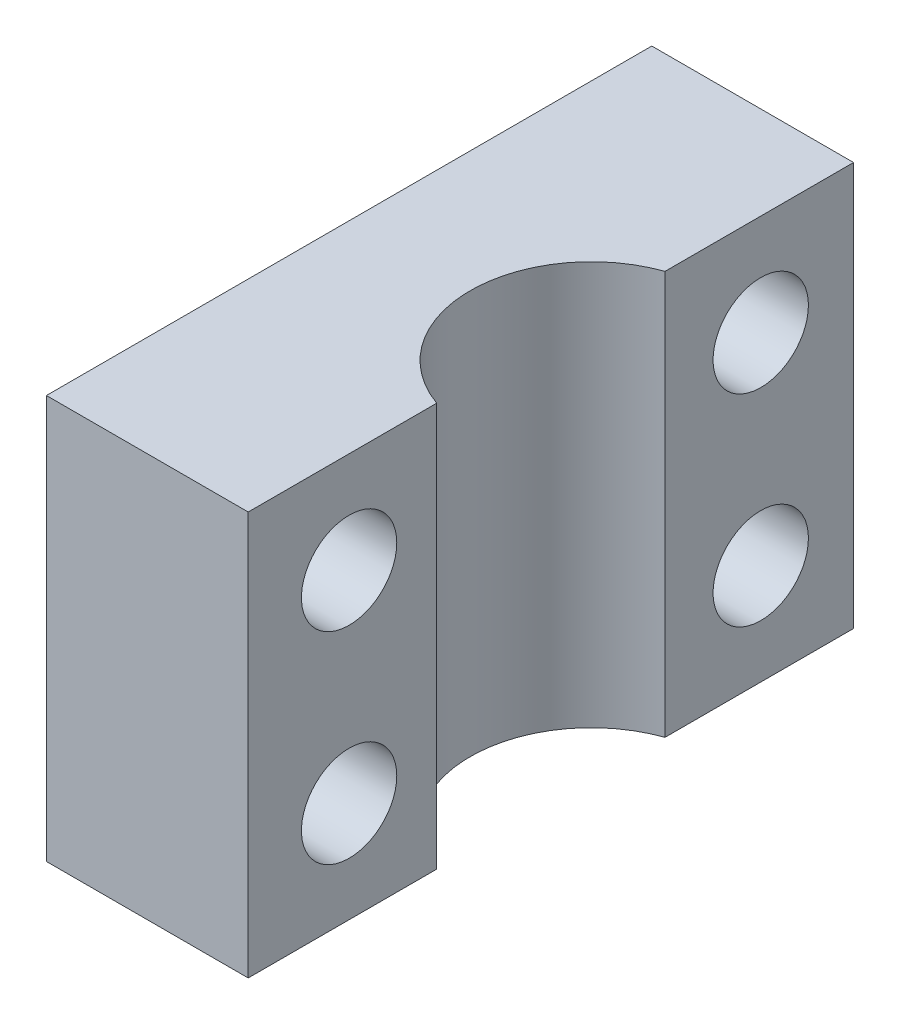
ISO-10303-21;
HEADER;
FILE_DESCRIPTION(('STEP AP214'),'2;1');
FILE_NAME('part.step','',(''),(''),'','','');
FILE_SCHEMA(('AUTOMOTIVE_DESIGN { 1 0 10303 214 1 1 1 1 }'));
ENDSEC;
DATA;
#1=APPLICATION_CONTEXT('core data for automotive mechanical design processes');
#2=APPLICATION_PROTOCOL_DEFINITION('international standard','automotive_design',2000,#1);
#3=PRODUCT_CONTEXT('',#1,'mechanical');
#4=PRODUCT('Part','Part','',(#3));
#5=PRODUCT_RELATED_PRODUCT_CATEGORY('part','',(#4));
#6=PRODUCT_DEFINITION_FORMATION('','',#4);
#7=PRODUCT_DEFINITION_CONTEXT('part definition',#1,'design');
#8=PRODUCT_DEFINITION('design','',#6,#7);
#9=PRODUCT_DEFINITION_SHAPE('','',#8);
#10=(LENGTH_UNIT() NAMED_UNIT(*) SI_UNIT(.MILLI.,.METRE.));
#11=(NAMED_UNIT(*) PLANE_ANGLE_UNIT() SI_UNIT($,.RADIAN.));
#12=(NAMED_UNIT(*) SI_UNIT($,.STERADIAN.) SOLID_ANGLE_UNIT());
#13=UNCERTAINTY_MEASURE_WITH_UNIT(LENGTH_MEASURE(1.E-05),#10,'distance_accuracy_value','');
#14=(GEOMETRIC_REPRESENTATION_CONTEXT(3) GLOBAL_UNCERTAINTY_ASSIGNED_CONTEXT((#13)) GLOBAL_UNIT_ASSIGNED_CONTEXT((#10,
#11,#12)) REPRESENTATION_CONTEXT('',''));
#15=CARTESIAN_POINT('',(0.,0.,0.));
#16=DIRECTION('',(0.,0.,1.));
#17=DIRECTION('',(1.,0.,0.));
#18=AXIS2_PLACEMENT_3D('',#15,#16,#17);
#19=CARTESIAN_POINT('',(0.,12.7,0.));
#20=DIRECTION('',(0.,-1.,0.));
#21=DIRECTION('',(0.,0.,-1.));
#22=AXIS2_PLACEMENT_3D('',#19,#20,#21);
#23=PLANE('',#22);
#24=DIRECTION('',(-1.,0.,0.));
#25=VECTOR('',#24,1.);
#26=CARTESIAN_POINT('',(0.,12.7,-19.05));
#27=LINE('',#26,#25);
#28=CARTESIAN_POINT('',(12.7,12.7,-19.05));
#29=VERTEX_POINT('',#28);
#30=CARTESIAN_POINT('',(6.35,12.7,-19.05));
#31=VERTEX_POINT('',#30);
#32=EDGE_CURVE('E99',#29,#31,#27,.T.);
#33=ORIENTED_EDGE('',*,*,#32,.T.);
#34=DIRECTION('',(0.,0.,1.));
#35=VECTOR('',#34,1.);
#36=CARTESIAN_POINT('',(6.35,12.7,0.));
#37=LINE('',#36,#35);
#38=CARTESIAN_POINT('',(6.35,12.7,0.));
#39=VERTEX_POINT('',#38);
#40=EDGE_CURVE('E120',#31,#39,#37,.T.);
#41=ORIENTED_EDGE('',*,*,#40,.T.);
#42=DIRECTION('',(1.,0.,0.));
#43=VECTOR('',#42,1.);
#44=CARTESIAN_POINT('',(0.,12.7,0.));
#45=LINE('',#44,#43);
#46=CARTESIAN_POINT('',(12.7,12.7,0.));
#47=VERTEX_POINT('',#46);
#48=EDGE_CURVE('E109',#39,#47,#45,.T.);
#49=ORIENTED_EDGE('',*,*,#48,.T.);
#50=DIRECTION('',(0.,0.,-1.));
#51=VECTOR('',#50,1.);
#52=CARTESIAN_POINT('',(12.7,12.7,0.));
#53=LINE('',#52,#51);
#54=CARTESIAN_POINT('',(12.7,12.7,-5.93289755157234));
#55=VERTEX_POINT('',#54);
#56=EDGE_CURVE('E169',#47,#55,#53,.T.);
#57=ORIENTED_EDGE('',*,*,#56,.T.);
#58=CARTESIAN_POINT('',(13.97,12.7,-9.525));
#59=DIRECTION('',(0.,1.,0.));
#60=DIRECTION('',(0.,0.,1.));
#61=AXIS2_PLACEMENT_3D('',#58,#59,#60);
#62=CIRCLE('',#61,3.81);
#63=CARTESIAN_POINT('',(12.7,12.7,-13.1171024484277));
#64=VERTEX_POINT('',#63);
#65=EDGE_CURVE('E153',#64,#55,#62,.T.);
#66=ORIENTED_EDGE('',*,*,#65,.F.);
#67=EDGE_CURVE('E66',#64,#29,#53,.T.);
#68=ORIENTED_EDGE('',*,*,#67,.T.);
#69=EDGE_LOOP('',(#33,#41,#49,#57,#66,#68));
#70=FACE_BOUND('',#69,.T.);
#71=ADVANCED_FACE('F39',(#70),#23,.F.);
#72=CARTESIAN_POINT('',(0.,0.,0.));
#73=DIRECTION('',(0.,-1.,0.));
#74=DIRECTION('',(0.,0.,-1.));
#75=AXIS2_PLACEMENT_3D('',#72,#73,#74);
#76=PLANE('',#75);
#77=DIRECTION('',(0.,0.,1.));
#78=VECTOR('',#77,1.);
#79=CARTESIAN_POINT('',(6.35,0.,0.));
#80=LINE('',#79,#78);
#81=CARTESIAN_POINT('',(6.35,0.,-19.05));
#82=VERTEX_POINT('',#81);
#83=CARTESIAN_POINT('',(6.35,0.,0.));
#84=VERTEX_POINT('',#83);
#85=EDGE_CURVE('E106',#82,#84,#80,.T.);
#86=ORIENTED_EDGE('',*,*,#85,.F.);
#87=DIRECTION('',(-1.,0.,0.));
#88=VECTOR('',#87,1.);
#89=CARTESIAN_POINT('',(0.,0.,-19.05));
#90=LINE('',#89,#88);
#91=CARTESIAN_POINT('',(12.7,0.,-19.05));
#92=VERTEX_POINT('',#91);
#93=EDGE_CURVE('E98',#92,#82,#90,.T.);
#94=ORIENTED_EDGE('',*,*,#93,.F.);
#95=DIRECTION('',(0.,0.,-1.));
#96=VECTOR('',#95,1.);
#97=CARTESIAN_POINT('',(12.7,0.,0.));
#98=LINE('',#97,#96);
#99=CARTESIAN_POINT('',(12.7,0.,-13.1171024484277));
#100=VERTEX_POINT('',#99);
#101=EDGE_CURVE('E80',#100,#92,#98,.T.);
#102=ORIENTED_EDGE('',*,*,#101,.F.);
#103=CARTESIAN_POINT('',(13.97,0.,-9.525));
#104=DIRECTION('',(0.,1.,0.));
#105=DIRECTION('',(0.,0.,1.));
#106=AXIS2_PLACEMENT_3D('',#103,#104,#105);
#107=CIRCLE('',#106,3.81);
#108=CARTESIAN_POINT('',(12.7,0.,-5.93289755157234));
#109=VERTEX_POINT('',#108);
#110=EDGE_CURVE('E158',#100,#109,#107,.T.);
#111=ORIENTED_EDGE('',*,*,#110,.T.);
#112=CARTESIAN_POINT('',(12.7,0.,0.));
#113=VERTEX_POINT('',#112);
#114=EDGE_CURVE('E90',#113,#109,#98,.T.);
#115=ORIENTED_EDGE('',*,*,#114,.F.);
#116=DIRECTION('',(1.,0.,0.));
#117=VECTOR('',#116,1.);
#118=CARTESIAN_POINT('',(0.,0.,0.));
#119=LINE('',#118,#117);
#120=EDGE_CURVE('E91',#84,#113,#119,.T.);
#121=ORIENTED_EDGE('',*,*,#120,.F.);
#122=EDGE_LOOP('',(#86,#94,#102,#111,#115,#121));
#123=FACE_BOUND('',#122,.T.);
#124=ADVANCED_FACE('F103',(#123),#76,.T.);
#125=CARTESIAN_POINT('',(0.,9.525,-16.129));
#126=DIRECTION('',(1.,0.,0.));
#127=DIRECTION('',(0.,0.,-1.));
#128=AXIS2_PLACEMENT_3D('',#125,#126,#127);
#129=CYLINDRICAL_SURFACE('',#128,1.5);
#130=CARTESIAN_POINT('',(12.7,9.525,-16.129));
#131=DIRECTION('',(1.,0.,0.));
#132=DIRECTION('',(0.,0.,-1.));
#133=AXIS2_PLACEMENT_3D('',#130,#131,#132);
#134=CIRCLE('',#133,1.5);
#135=CARTESIAN_POINT('',(12.7,9.525,-17.629));
#136=VERTEX_POINT('',#135);
#137=EDGE_CURVE('E138',#136,#136,#134,.T.);
#138=ORIENTED_EDGE('',*,*,#137,.T.);
#139=EDGE_LOOP('',(#138));
#140=FACE_BOUND('',#139,.T.);
#141=CARTESIAN_POINT('',(6.35,9.525,-16.129));
#142=DIRECTION('',(-1.,0.,0.));
#143=DIRECTION('',(0.,0.,1.));
#144=AXIS2_PLACEMENT_3D('',#141,#142,#143);
#145=CIRCLE('',#144,1.5);
#146=CARTESIAN_POINT('',(6.35,9.525,-14.629));
#147=VERTEX_POINT('',#146);
#148=EDGE_CURVE('E134',#147,#147,#145,.F.);
#149=ORIENTED_EDGE('',*,*,#148,.F.);
#150=EDGE_LOOP('',(#149));
#151=FACE_BOUND('',#150,.T.);
#152=ADVANCED_FACE('F202',(#140,#151),#129,.F.);
#153=CARTESIAN_POINT('',(0.,3.175,-16.1290000000001));
#154=DIRECTION('',(1.,0.,0.));
#155=DIRECTION('',(0.,0.,-1.));
#156=AXIS2_PLACEMENT_3D('',#153,#154,#155);
#157=CYLINDRICAL_SURFACE('',#156,1.5);
#158=CARTESIAN_POINT('',(12.7,3.175,-16.1290000000001));
#159=DIRECTION('',(1.,0.,0.));
#160=DIRECTION('',(0.,0.,-1.));
#161=AXIS2_PLACEMENT_3D('',#158,#159,#160);
#162=CIRCLE('',#161,1.5);
#163=CARTESIAN_POINT('',(12.7,3.175,-17.6290000000001));
#164=VERTEX_POINT('',#163);
#165=EDGE_CURVE('E143',#164,#164,#162,.T.);
#166=ORIENTED_EDGE('',*,*,#165,.T.);
#167=EDGE_LOOP('',(#166));
#168=FACE_BOUND('',#167,.T.);
#169=CARTESIAN_POINT('',(6.35,3.175,-16.1290000000001));
#170=DIRECTION('',(-1.,0.,0.));
#171=DIRECTION('',(0.,0.,1.));
#172=AXIS2_PLACEMENT_3D('',#169,#170,#171);
#173=CIRCLE('',#172,1.5);
#174=CARTESIAN_POINT('',(6.35,3.175,-14.6290000000001));
#175=VERTEX_POINT('',#174);
#176=EDGE_CURVE('E43',#175,#175,#173,.F.);
#177=ORIENTED_EDGE('',*,*,#176,.F.);
#178=EDGE_LOOP('',(#177));
#179=FACE_BOUND('',#178,.T.);
#180=ADVANCED_FACE('F216',(#168,#179),#157,.F.);
#181=CARTESIAN_POINT('',(12.7,12.7,0.));
#182=DIRECTION('',(-1.,0.,0.));
#183=DIRECTION('',(0.,0.,1.));
#184=AXIS2_PLACEMENT_3D('',#181,#182,#183);
#185=PLANE('',#184);
#186=CARTESIAN_POINT('',(12.7,3.175,-3.17500000000007));
#187=DIRECTION('',(1.,0.,0.));
#188=DIRECTION('',(0.,0.,-1.));
#189=AXIS2_PLACEMENT_3D('',#186,#187,#188);
#190=CIRCLE('',#189,1.5);
#191=CARTESIAN_POINT('',(12.7,3.175,-4.67500000000007));
#192=VERTEX_POINT('',#191);
#193=EDGE_CURVE('E126',#192,#192,#190,.T.);
#194=ORIENTED_EDGE('',*,*,#193,.F.);
#195=EDGE_LOOP('',(#194));
#196=FACE_BOUND('',#195,.T.);
#197=CARTESIAN_POINT('',(12.7,9.525,-3.175));
#198=DIRECTION('',(1.,0.,0.));
#199=DIRECTION('',(0.,0.,-1.));
#200=AXIS2_PLACEMENT_3D('',#197,#198,#199);
#201=CIRCLE('',#200,1.5);
#202=CARTESIAN_POINT('',(12.7,9.525,-4.675));
#203=VERTEX_POINT('',#202);
#204=EDGE_CURVE('E142',#203,#203,#201,.T.);
#205=ORIENTED_EDGE('',*,*,#204,.F.);
#206=EDGE_LOOP('',(#205));
#207=FACE_BOUND('',#206,.T.);
#208=ORIENTED_EDGE('',*,*,#114,.T.);
#209=DIRECTION('',(0.,1.,0.));
#210=VECTOR('',#209,1.);
#211=CARTESIAN_POINT('',(12.7,0.,-5.93289755157234));
#212=LINE('',#211,#210);
#213=EDGE_CURVE('E57',#109,#55,#212,.T.);
#214=ORIENTED_EDGE('',*,*,#213,.T.);
#215=ORIENTED_EDGE('',*,*,#56,.F.);
#216=DIRECTION('',(0.,-1.,0.));
#217=VECTOR('',#216,1.);
#218=CARTESIAN_POINT('',(12.7,12.7,0.));
#219=LINE('',#218,#217);
#220=EDGE_CURVE('E12',#47,#113,#219,.T.);
#221=ORIENTED_EDGE('',*,*,#220,.T.);
#222=EDGE_LOOP('',(#208,#214,#215,#221));
#223=FACE_BOUND('',#222,.T.);
#224=ADVANCED_FACE('F183',(#196,#207,#223),#185,.F.);
#225=CARTESIAN_POINT('',(0.,12.7,0.));
#226=DIRECTION('',(0.,0.,-1.));
#227=DIRECTION('',(-1.,0.,0.));
#228=AXIS2_PLACEMENT_3D('',#225,#226,#227);
#229=PLANE('',#228);
#230=ORIENTED_EDGE('',*,*,#48,.F.);
#231=DIRECTION('',(0.,1.,0.));
#232=VECTOR('',#231,1.);
#233=CARTESIAN_POINT('',(6.35,0.,0.));
#234=LINE('',#233,#232);
#235=EDGE_CURVE('E154',#84,#39,#234,.T.);
#236=ORIENTED_EDGE('',*,*,#235,.F.);
#237=ORIENTED_EDGE('',*,*,#120,.T.);
#238=ORIENTED_EDGE('',*,*,#220,.F.);
#239=EDGE_LOOP('',(#230,#236,#237,#238));
#240=FACE_BOUND('',#239,.T.);
#241=ADVANCED_FACE('F41',(#240),#229,.F.);
#242=ORIENTED_EDGE('',*,*,#165,.F.);
#243=EDGE_LOOP('',(#242));
#244=FACE_BOUND('',#243,.T.);
#245=ORIENTED_EDGE('',*,*,#137,.F.);
#246=EDGE_LOOP('',(#245));
#247=FACE_BOUND('',#246,.T.);
#248=ORIENTED_EDGE('',*,*,#67,.F.);
#249=DIRECTION('',(0.,1.,0.));
#250=VECTOR('',#249,1.);
#251=CARTESIAN_POINT('',(12.7,0.,-13.1171024484277));
#252=LINE('',#251,#250);
#253=EDGE_CURVE('E86',#100,#64,#252,.T.);
#254=ORIENTED_EDGE('',*,*,#253,.F.);
#255=ORIENTED_EDGE('',*,*,#101,.T.);
#256=DIRECTION('',(0.,-1.,0.));
#257=VECTOR('',#256,1.);
#258=CARTESIAN_POINT('',(12.7,12.7,-19.05));
#259=LINE('',#258,#257);
#260=EDGE_CURVE('E49',#29,#92,#259,.T.);
#261=ORIENTED_EDGE('',*,*,#260,.F.);
#262=EDGE_LOOP('',(#248,#254,#255,#261));
#263=FACE_BOUND('',#262,.T.);
#264=ADVANCED_FACE('F82',(#244,#247,#263),#185,.F.);
#265=CARTESIAN_POINT('',(0.,12.7,-19.05));
#266=DIRECTION('',(0.,0.,1.));
#267=DIRECTION('',(1.,0.,0.));
#268=AXIS2_PLACEMENT_3D('',#265,#266,#267);
#269=PLANE('',#268);
#270=ORIENTED_EDGE('',*,*,#93,.T.);
#271=DIRECTION('',(0.,1.,0.));
#272=VECTOR('',#271,1.);
#273=CARTESIAN_POINT('',(6.35,0.,-19.05));
#274=LINE('',#273,#272);
#275=EDGE_CURVE('E157',#82,#31,#274,.T.);
#276=ORIENTED_EDGE('',*,*,#275,.T.);
#277=ORIENTED_EDGE('',*,*,#32,.F.);
#278=ORIENTED_EDGE('',*,*,#260,.T.);
#279=EDGE_LOOP('',(#270,#276,#277,#278));
#280=FACE_BOUND('',#279,.T.);
#281=ADVANCED_FACE('F95',(#280),#269,.F.);
#282=CARTESIAN_POINT('',(13.97,0.,-9.525));
#283=DIRECTION('',(0.,1.,0.));
#284=DIRECTION('',(0.,0.,1.));
#285=AXIS2_PLACEMENT_3D('',#282,#283,#284);
#286=CYLINDRICAL_SURFACE('',#285,3.81);
#287=ORIENTED_EDGE('',*,*,#65,.T.);
#288=ORIENTED_EDGE('',*,*,#213,.F.);
#289=ORIENTED_EDGE('',*,*,#110,.F.);
#290=ORIENTED_EDGE('',*,*,#253,.T.);
#291=EDGE_LOOP('',(#287,#288,#289,#290));
#292=FACE_BOUND('',#291,.T.);
#293=ADVANCED_FACE('F184',(#292),#286,.F.);
#294=CARTESIAN_POINT('',(0.,9.525,-3.175));
#295=DIRECTION('',(1.,0.,0.));
#296=DIRECTION('',(0.,0.,-1.));
#297=AXIS2_PLACEMENT_3D('',#294,#295,#296);
#298=CYLINDRICAL_SURFACE('',#297,1.5);
#299=CARTESIAN_POINT('',(6.35,9.525,-3.175));
#300=DIRECTION('',(1.,0.,0.));
#301=DIRECTION('',(0.,0.,-1.));
#302=AXIS2_PLACEMENT_3D('',#299,#300,#301);
#303=CIRCLE('',#302,1.5);
#304=CARTESIAN_POINT('',(6.35,9.525,-4.675));
#305=VERTEX_POINT('',#304);
#306=EDGE_CURVE('E119',#305,#305,#303,.F.);
#307=ORIENTED_EDGE('',*,*,#306,.T.);
#308=EDGE_LOOP('',(#307));
#309=FACE_BOUND('',#308,.T.);
#310=ORIENTED_EDGE('',*,*,#204,.T.);
#311=EDGE_LOOP('',(#310));
#312=FACE_BOUND('',#311,.T.);
#313=ADVANCED_FACE('F227',(#309,#312),#298,.F.);
#314=CARTESIAN_POINT('',(0.,3.175,-3.17500000000007));
#315=DIRECTION('',(1.,0.,0.));
#316=DIRECTION('',(0.,0.,-1.));
#317=AXIS2_PLACEMENT_3D('',#314,#315,#316);
#318=CYLINDRICAL_SURFACE('',#317,1.5);
#319=CARTESIAN_POINT('',(6.35,3.175,-3.17500000000007));
#320=DIRECTION('',(1.,0.,0.));
#321=DIRECTION('',(0.,0.,-1.));
#322=AXIS2_PLACEMENT_3D('',#319,#320,#321);
#323=CIRCLE('',#322,1.5);
#324=CARTESIAN_POINT('',(6.35,3.175,-4.67500000000007));
#325=VERTEX_POINT('',#324);
#326=EDGE_CURVE('E116',#325,#325,#323,.F.);
#327=ORIENTED_EDGE('',*,*,#326,.T.);
#328=EDGE_LOOP('',(#327));
#329=FACE_BOUND('',#328,.T.);
#330=ORIENTED_EDGE('',*,*,#193,.T.);
#331=EDGE_LOOP('',(#330));
#332=FACE_BOUND('',#331,.T.);
#333=ADVANCED_FACE('F229',(#329,#332),#318,.F.);
#334=CARTESIAN_POINT('',(6.35,12.7,0.));
#335=DIRECTION('',(1.,0.,0.));
#336=DIRECTION('',(0.,0.,-1.));
#337=AXIS2_PLACEMENT_3D('',#334,#335,#336);
#338=PLANE('',#337);
#339=ORIENTED_EDGE('',*,*,#306,.F.);
#340=EDGE_LOOP('',(#339));
#341=FACE_BOUND('',#340,.T.);
#342=ORIENTED_EDGE('',*,*,#326,.F.);
#343=EDGE_LOOP('',(#342));
#344=FACE_BOUND('',#343,.T.);
#345=ORIENTED_EDGE('',*,*,#235,.T.);
#346=ORIENTED_EDGE('',*,*,#40,.F.);
#347=ORIENTED_EDGE('',*,*,#275,.F.);
#348=ORIENTED_EDGE('',*,*,#85,.T.);
#349=EDGE_LOOP('',(#345,#346,#347,#348));
#350=FACE_BOUND('',#349,.T.);
#351=ORIENTED_EDGE('',*,*,#176,.T.);
#352=EDGE_LOOP('',(#351));
#353=FACE_BOUND('',#352,.T.);
#354=ORIENTED_EDGE('',*,*,#148,.T.);
#355=EDGE_LOOP('',(#354));
#356=FACE_BOUND('',#355,.T.);
#357=ADVANCED_FACE('F194',(#341,#344,#350,#353,#356),#338,.F.);
#358=CLOSED_SHELL('',(#71,#124,#152,#180,#224,#241,#264,#281,#293,#313,#333,#357));
#359=MANIFOLD_SOLID_BREP('B2',#358);
#360=ADVANCED_BREP_SHAPE_REPRESENTATION('',(#18,#359),#14);
#361=SHAPE_DEFINITION_REPRESENTATION(#9,#360);
ENDSEC;
END-ISO-10303-21;
